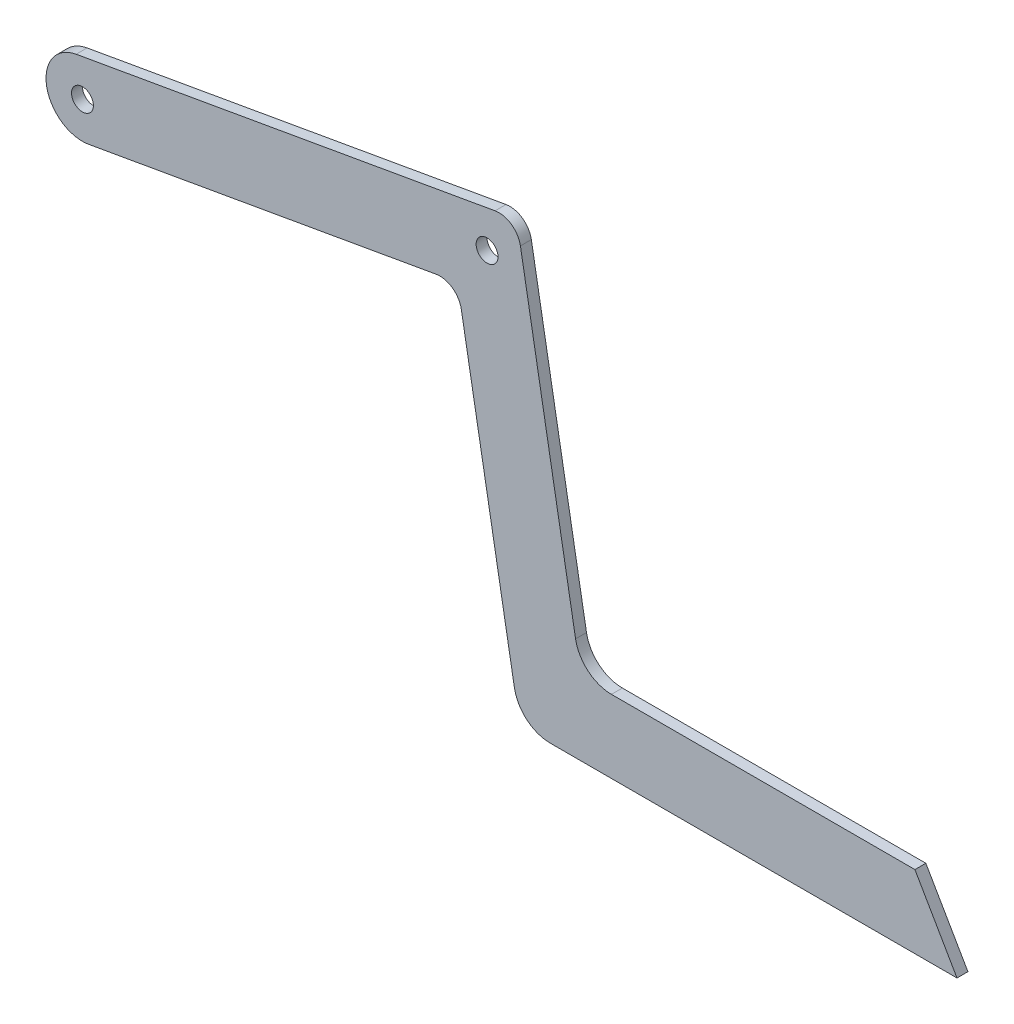
ISO-10303-21;
HEADER;
FILE_DESCRIPTION(('STEP AP214'),'2;1');
FILE_NAME('part.step','',(''),(''),'','','');
FILE_SCHEMA(('AUTOMOTIVE_DESIGN { 1 0 10303 214 1 1 1 1 }'));
ENDSEC;
DATA;
#1=APPLICATION_CONTEXT('core data for automotive mechanical design processes');
#2=APPLICATION_PROTOCOL_DEFINITION('international standard','automotive_design',2000,#1);
#3=PRODUCT_CONTEXT('',#1,'mechanical');
#4=PRODUCT('Part','Part','',(#3));
#5=PRODUCT_RELATED_PRODUCT_CATEGORY('part','',(#4));
#6=PRODUCT_DEFINITION_FORMATION('','',#4);
#7=PRODUCT_DEFINITION_CONTEXT('part definition',#1,'design');
#8=PRODUCT_DEFINITION('design','',#6,#7);
#9=PRODUCT_DEFINITION_SHAPE('','',#8);
#10=(LENGTH_UNIT() NAMED_UNIT(*) SI_UNIT(.MILLI.,.METRE.));
#11=(NAMED_UNIT(*) PLANE_ANGLE_UNIT() SI_UNIT($,.RADIAN.));
#12=(NAMED_UNIT(*) SI_UNIT($,.STERADIAN.) SOLID_ANGLE_UNIT());
#13=UNCERTAINTY_MEASURE_WITH_UNIT(LENGTH_MEASURE(1.E-05),#10,'distance_accuracy_value','');
#14=(GEOMETRIC_REPRESENTATION_CONTEXT(3) GLOBAL_UNCERTAINTY_ASSIGNED_CONTEXT((#13)) GLOBAL_UNIT_ASSIGNED_CONTEXT((#10,
#11,#12)) REPRESENTATION_CONTEXT('',''));
#15=CARTESIAN_POINT('',(0.,0.,0.));
#16=DIRECTION('',(0.,0.,1.));
#17=DIRECTION('',(1.,0.,0.));
#18=AXIS2_PLACEMENT_3D('',#15,#16,#17);
#19=CARTESIAN_POINT('',(4.19549815590958,5.00000000000001,0.75));
#20=DIRECTION('',(0.,0.,1.));
#21=DIRECTION('',(1.,0.,0.));
#22=AXIS2_PLACEMENT_3D('',#19,#20,#21);
#23=PLANE('',#22);
#24=CARTESIAN_POINT('',(-60.,44.4182492595607,0.75));
#25=DIRECTION('',(0.,0.,1.));
#26=DIRECTION('',(1.,0.,0.));
#27=AXIS2_PLACEMENT_3D('',#24,#25,#26);
#28=CIRCLE('',#27,1.5);
#29=CARTESIAN_POINT('',(-58.5,44.4182492595607,0.75));
#30=VERTEX_POINT('',#29);
#31=EDGE_CURVE('E162',#30,#30,#28,.T.);
#32=ORIENTED_EDGE('',*,*,#31,.F.);
#33=EDGE_LOOP('',(#32));
#34=FACE_BOUND('',#33,.T.);
#35=CARTESIAN_POINT('',(4.19549815590958,5.00000000000001,0.75));
#36=DIRECTION('',(0.,0.,1.));
#37=DIRECTION('',(1.,0.,0.));
#38=AXIS2_PLACEMENT_3D('',#35,#36,#37);
#39=CIRCLE('',#38,5.00000000000006);
#40=CARTESIAN_POINT('',(-0.728540609152036,4.13175911166798,0.75));
#41=VERTEX_POINT('',#40);
#42=CARTESIAN_POINT('',(4.19549815590947,0.,0.75));
#43=VERTEX_POINT('',#42);
#44=EDGE_CURVE('E181',#41,#43,#39,.T.);
#45=ORIENTED_EDGE('',*,*,#44,.T.);
#46=DIRECTION('',(1.,0.,0.));
#47=VECTOR('',#46,1.);
#48=CARTESIAN_POINT('',(4.19549815590947,0.,0.75));
#49=LINE('',#48,#47);
#50=CARTESIAN_POINT('',(60.,0.,0.75));
#51=VERTEX_POINT('',#50);
#52=EDGE_CURVE('E109',#43,#51,#49,.T.);
#53=ORIENTED_EDGE('',*,*,#52,.T.);
#54=DIRECTION('',(-0.500000000000005,0.866025403784436,0.));
#55=VECTOR('',#54,1.);
#56=CARTESIAN_POINT('',(60.,0.,0.75));
#57=LINE('',#56,#55);
#58=CARTESIAN_POINT('',(54.2264973081037,10.,0.75));
#59=VERTEX_POINT('',#58);
#60=EDGE_CURVE('E208',#51,#59,#57,.T.);
#61=ORIENTED_EDGE('',*,*,#60,.T.);
#62=DIRECTION('',(-1.,0.,0.));
#63=VECTOR('',#62,1.);
#64=CARTESIAN_POINT('',(54.2264973081037,10.,0.75));
#65=LINE('',#64,#63);
#66=CARTESIAN_POINT('',(12.5864944676832,9.99999999999995,0.75));
#67=VERTEX_POINT('',#66);
#68=EDGE_CURVE('E227',#59,#67,#65,.T.);
#69=ORIENTED_EDGE('',*,*,#68,.T.);
#70=CARTESIAN_POINT('',(12.5864944676833,15.,0.75));
#71=DIRECTION('',(0.,0.,-1.));
#72=DIRECTION('',(1.,0.,0.));
#73=AXIS2_PLACEMENT_3D('',#70,#71,#72);
#74=CIRCLE('',#73,5.00000000000005);
#75=CARTESIAN_POINT('',(7.66245570262213,14.1317591116654,0.75));
#76=VERTEX_POINT('',#75);
#77=EDGE_CURVE('E224',#67,#76,#74,.T.);
#78=ORIENTED_EDGE('',*,*,#77,.T.);
#79=DIRECTION('',(-0.173648177666937,0.984807753012207,0.));
#80=VECTOR('',#79,1.);
#81=CARTESIAN_POINT('',(7.66245570262213,14.1317591116654,0.75));
#82=LINE('',#81,#80);
#83=CARTESIAN_POINT('',(0.0955918093733577,57.0455767409672,0.75));
#84=VERTEX_POINT('',#83);
#85=EDGE_CURVE('E226',#76,#84,#82,.T.);
#86=ORIENTED_EDGE('',*,*,#85,.T.);
#87=CARTESIAN_POINT('',(-2.85883144965899,56.5246322079671,0.75));
#88=DIRECTION('',(0.,0.,1.));
#89=DIRECTION('',(1.,0.,0.));
#90=AXIS2_PLACEMENT_3D('',#87,#88,#89);
#91=CIRCLE('',#90,2.99999999999566);
#92=CARTESIAN_POINT('',(-3.37977598265879,59.4790554669995,0.75));
#93=VERTEX_POINT('',#92);
#94=EDGE_CURVE('E229',#84,#93,#91,.T.);
#95=ORIENTED_EDGE('',*,*,#94,.T.);
#96=DIRECTION('',(-0.984807753012222,-0.173648177666854,0.));
#97=VECTOR('',#96,1.);
#98=CARTESIAN_POINT('',(-3.37977598265879,59.4790554669995,0.75));
#99=LINE('',#98,#97);
#100=CARTESIAN_POINT('',(-60.8682408883343,49.3422880246218,0.75));
#101=VERTEX_POINT('',#100);
#102=EDGE_CURVE('E235',#93,#101,#99,.T.);
#103=ORIENTED_EDGE('',*,*,#102,.T.);
#104=CARTESIAN_POINT('',(-60.,44.4182492595607,0.75));
#105=DIRECTION('',(0.,0.,1.));
#106=DIRECTION('',(1.,0.,0.));
#107=AXIS2_PLACEMENT_3D('',#104,#105,#106);
#108=CIRCLE('',#107,5.);
#109=CARTESIAN_POINT('',(-59.1317591116657,39.4942104944996,0.75));
#110=VERTEX_POINT('',#109);
#111=EDGE_CURVE('E140',#101,#110,#108,.T.);
#112=ORIENTED_EDGE('',*,*,#111,.T.);
#113=DIRECTION('',(0.984807753012221,0.173648177666854,0.));
#114=VECTOR('',#113,1.);
#115=CARTESIAN_POINT('',(-11.4913717361126,47.8944961602088,0.75));
#116=LINE('',#115,#114);
#117=CARTESIAN_POINT('',(-11.4913717361126,47.8944961602087,0.75));
#118=VERTEX_POINT('',#117);
#119=EDGE_CURVE('E134',#110,#118,#116,.T.);
#120=ORIENTED_EDGE('',*,*,#119,.T.);
#121=CARTESIAN_POINT('',(-10.9704272031127,44.9400729011758,0.75));
#122=DIRECTION('',(0.,0.,-1.));
#123=DIRECTION('',(-1.,0.,0.));
#124=AXIS2_PLACEMENT_3D('',#121,#122,#123);
#125=CIRCLE('',#124,2.9999999999962);
#126=CARTESIAN_POINT('',(-8.01600394407981,45.4610174341759,0.75));
#127=VERTEX_POINT('',#126);
#128=EDGE_CURVE('E138',#118,#127,#125,.T.);
#129=ORIENTED_EDGE('',*,*,#128,.T.);
#130=DIRECTION('',(0.173648177666925,-0.984807753012209,0.));
#131=VECTOR('',#130,1.);
#132=CARTESIAN_POINT('',(-8.01600394407981,45.4610174341759,0.75));
#133=LINE('',#132,#131);
#134=EDGE_CURVE('E54',#127,#41,#133,.T.);
#135=ORIENTED_EDGE('',*,*,#134,.T.);
#136=EDGE_LOOP('',(#45,#53,#61,#69,#78,#86,#95,#103,#112,#120,#129,#135));
#137=FACE_BOUND('',#136,.T.);
#138=CARTESIAN_POINT('',(-4.48115060035267,54.2077203466046,0.75));
#139=DIRECTION('',(0.,0.,1.));
#140=DIRECTION('',(1.,0.,0.));
#141=AXIS2_PLACEMENT_3D('',#138,#139,#140);
#142=CIRCLE('',#141,1.5);
#143=CARTESIAN_POINT('',(-2.98115060035267,54.2077203466046,0.75));
#144=VERTEX_POINT('',#143);
#145=EDGE_CURVE('E277',#144,#144,#142,.T.);
#146=ORIENTED_EDGE('',*,*,#145,.F.);
#147=EDGE_LOOP('',(#146));
#148=FACE_BOUND('',#147,.T.);
#149=ADVANCED_FACE('F37',(#34,#137,#148),#23,.T.);
#150=CARTESIAN_POINT('',(4.19549815590958,5.00000000000001,-0.75));
#151=DIRECTION('',(0.,0.,1.));
#152=DIRECTION('',(1.,0.,0.));
#153=AXIS2_PLACEMENT_3D('',#150,#151,#152);
#154=PLANE('',#153);
#155=CARTESIAN_POINT('',(4.19549815590958,5.00000000000001,-0.75));
#156=DIRECTION('',(0.,0.,1.));
#157=DIRECTION('',(1.,0.,0.));
#158=AXIS2_PLACEMENT_3D('',#155,#156,#157);
#159=CIRCLE('',#158,5.00000000000006);
#160=CARTESIAN_POINT('',(-0.728540609152036,4.13175911166798,-0.75));
#161=VERTEX_POINT('',#160);
#162=CARTESIAN_POINT('',(4.19549815590947,0.,-0.75));
#163=VERTEX_POINT('',#162);
#164=EDGE_CURVE('E158',#161,#163,#159,.T.);
#165=ORIENTED_EDGE('',*,*,#164,.F.);
#166=DIRECTION('',(0.173648177666925,-0.984807753012209,0.));
#167=VECTOR('',#166,1.);
#168=CARTESIAN_POINT('',(-8.01600394407981,45.4610174341759,-0.75));
#169=LINE('',#168,#167);
#170=CARTESIAN_POINT('',(-8.01600394407981,45.4610174341759,-0.75));
#171=VERTEX_POINT('',#170);
#172=EDGE_CURVE('E101',#171,#161,#169,.T.);
#173=ORIENTED_EDGE('',*,*,#172,.F.);
#174=CARTESIAN_POINT('',(-10.9704272031127,44.9400729011758,-0.75));
#175=DIRECTION('',(0.,0.,-1.));
#176=DIRECTION('',(-1.,0.,0.));
#177=AXIS2_PLACEMENT_3D('',#174,#175,#176);
#178=CIRCLE('',#177,2.9999999999962);
#179=CARTESIAN_POINT('',(-11.4913717361126,47.8944961602087,-0.75));
#180=VERTEX_POINT('',#179);
#181=EDGE_CURVE('E95',#180,#171,#178,.T.);
#182=ORIENTED_EDGE('',*,*,#181,.F.);
#183=DIRECTION('',(0.984807753012221,0.173648177666854,0.));
#184=VECTOR('',#183,1.);
#185=CARTESIAN_POINT('',(-11.4913717361126,47.8944961602088,-0.75));
#186=LINE('',#185,#184);
#187=CARTESIAN_POINT('',(-59.1317591116657,39.4942104944996,-0.75));
#188=VERTEX_POINT('',#187);
#189=EDGE_CURVE('E148',#188,#180,#186,.T.);
#190=ORIENTED_EDGE('',*,*,#189,.F.);
#191=CARTESIAN_POINT('',(-60.,44.4182492595607,-0.75));
#192=DIRECTION('',(0.,0.,1.));
#193=DIRECTION('',(1.,0.,0.));
#194=AXIS2_PLACEMENT_3D('',#191,#192,#193);
#195=CIRCLE('',#194,5.);
#196=CARTESIAN_POINT('',(-60.8682408883343,49.3422880246218,-0.75));
#197=VERTEX_POINT('',#196);
#198=EDGE_CURVE('E176',#197,#188,#195,.T.);
#199=ORIENTED_EDGE('',*,*,#198,.F.);
#200=DIRECTION('',(-0.984807753012222,-0.173648177666854,0.));
#201=VECTOR('',#200,1.);
#202=CARTESIAN_POINT('',(-3.37977598265879,59.4790554669995,-0.75));
#203=LINE('',#202,#201);
#204=CARTESIAN_POINT('',(-3.37977598265879,59.4790554669995,-0.75));
#205=VERTEX_POINT('',#204);
#206=EDGE_CURVE('E174',#205,#197,#203,.T.);
#207=ORIENTED_EDGE('',*,*,#206,.F.);
#208=CARTESIAN_POINT('',(-2.85883144965899,56.5246322079671,-0.75));
#209=DIRECTION('',(0.,0.,1.));
#210=DIRECTION('',(1.,0.,0.));
#211=AXIS2_PLACEMENT_3D('',#208,#209,#210);
#212=CIRCLE('',#211,2.99999999999566);
#213=CARTESIAN_POINT('',(0.0955918093733577,57.0455767409672,-0.75));
#214=VERTEX_POINT('',#213);
#215=EDGE_CURVE('E172',#214,#205,#212,.T.);
#216=ORIENTED_EDGE('',*,*,#215,.F.);
#217=DIRECTION('',(-0.173648177666937,0.984807753012207,0.));
#218=VECTOR('',#217,1.);
#219=CARTESIAN_POINT('',(7.66245570262213,14.1317591116654,-0.75));
#220=LINE('',#219,#218);
#221=CARTESIAN_POINT('',(7.66245570262213,14.1317591116654,-0.75));
#222=VERTEX_POINT('',#221);
#223=EDGE_CURVE('E170',#222,#214,#220,.T.);
#224=ORIENTED_EDGE('',*,*,#223,.F.);
#225=CARTESIAN_POINT('',(12.5864944676833,15.,-0.75));
#226=DIRECTION('',(0.,0.,-1.));
#227=DIRECTION('',(1.,0.,0.));
#228=AXIS2_PLACEMENT_3D('',#225,#226,#227);
#229=CIRCLE('',#228,5.00000000000005);
#230=CARTESIAN_POINT('',(12.5864944676832,9.99999999999995,-0.75));
#231=VERTEX_POINT('',#230);
#232=EDGE_CURVE('E168',#231,#222,#229,.T.);
#233=ORIENTED_EDGE('',*,*,#232,.F.);
#234=DIRECTION('',(-1.,0.,0.));
#235=VECTOR('',#234,1.);
#236=CARTESIAN_POINT('',(54.2264973081037,10.,-0.75));
#237=LINE('',#236,#235);
#238=CARTESIAN_POINT('',(54.2264973081037,10.,-0.75));
#239=VERTEX_POINT('',#238);
#240=EDGE_CURVE('E166',#239,#231,#237,.T.);
#241=ORIENTED_EDGE('',*,*,#240,.F.);
#242=DIRECTION('',(-0.500000000000005,0.866025403784436,0.));
#243=VECTOR('',#242,1.);
#244=CARTESIAN_POINT('',(60.,0.,-0.75));
#245=LINE('',#244,#243);
#246=CARTESIAN_POINT('',(60.,0.,-0.75));
#247=VERTEX_POINT('',#246);
#248=EDGE_CURVE('E164',#247,#239,#245,.T.);
#249=ORIENTED_EDGE('',*,*,#248,.F.);
#250=DIRECTION('',(1.,0.,0.));
#251=VECTOR('',#250,1.);
#252=CARTESIAN_POINT('',(4.19549815590947,0.,-0.75));
#253=LINE('',#252,#251);
#254=EDGE_CURVE('E161',#163,#247,#253,.T.);
#255=ORIENTED_EDGE('',*,*,#254,.F.);
#256=EDGE_LOOP('',(#165,#173,#182,#190,#199,#207,#216,#224,#233,#241,#249,#255));
#257=FACE_BOUND('',#256,.T.);
#258=CARTESIAN_POINT('',(-60.,44.4182492595607,-0.75));
#259=DIRECTION('',(0.,0.,1.));
#260=DIRECTION('',(1.,0.,0.));
#261=AXIS2_PLACEMENT_3D('',#258,#259,#260);
#262=CIRCLE('',#261,1.5);
#263=CARTESIAN_POINT('',(-58.5,44.4182492595607,-0.75));
#264=VERTEX_POINT('',#263);
#265=EDGE_CURVE('E283',#264,#264,#262,.T.);
#266=ORIENTED_EDGE('',*,*,#265,.T.);
#267=EDGE_LOOP('',(#266));
#268=FACE_BOUND('',#267,.T.);
#269=CARTESIAN_POINT('',(-4.48115060035267,54.2077203466046,-0.75));
#270=DIRECTION('',(0.,0.,1.));
#271=DIRECTION('',(1.,0.,0.));
#272=AXIS2_PLACEMENT_3D('',#269,#270,#271);
#273=CIRCLE('',#272,1.5);
#274=CARTESIAN_POINT('',(-2.98115060035267,54.2077203466046,-0.75));
#275=VERTEX_POINT('',#274);
#276=EDGE_CURVE('E280',#275,#275,#273,.T.);
#277=ORIENTED_EDGE('',*,*,#276,.T.);
#278=EDGE_LOOP('',(#277));
#279=FACE_BOUND('',#278,.T.);
#280=ADVANCED_FACE('F212',(#257,#268,#279),#154,.F.);
#281=CARTESIAN_POINT('',(4.19549815590958,5.00000000000001,0.75));
#282=DIRECTION('',(0.,0.,-1.));
#283=DIRECTION('',(-1.,0.,0.));
#284=AXIS2_PLACEMENT_3D('',#281,#282,#283);
#285=CYLINDRICAL_SURFACE('',#284,5.00000000000006);
#286=ORIENTED_EDGE('',*,*,#164,.T.);
#287=DIRECTION('',(0.,0.,-1.));
#288=VECTOR('',#287,1.);
#289=CARTESIAN_POINT('',(4.19549815590947,0.,0.75));
#290=LINE('',#289,#288);
#291=EDGE_CURVE('E11',#43,#163,#290,.T.);
#292=ORIENTED_EDGE('',*,*,#291,.F.);
#293=ORIENTED_EDGE('',*,*,#44,.F.);
#294=DIRECTION('',(0.,0.,-1.));
#295=VECTOR('',#294,1.);
#296=CARTESIAN_POINT('',(-0.728540609152036,4.13175911166798,0.75));
#297=LINE('',#296,#295);
#298=EDGE_CURVE('E154',#41,#161,#297,.T.);
#299=ORIENTED_EDGE('',*,*,#298,.T.);
#300=EDGE_LOOP('',(#286,#292,#293,#299));
#301=FACE_BOUND('',#300,.T.);
#302=ADVANCED_FACE('F39',(#301),#285,.T.);
#303=CARTESIAN_POINT('',(4.19549815590947,0.,0.75));
#304=DIRECTION('',(0.,1.,0.));
#305=DIRECTION('',(-1.,0.,0.));
#306=AXIS2_PLACEMENT_3D('',#303,#304,#305);
#307=PLANE('',#306);
#308=ORIENTED_EDGE('',*,*,#254,.T.);
#309=DIRECTION('',(0.,0.,-1.));
#310=VECTOR('',#309,1.);
#311=CARTESIAN_POINT('',(60.,0.,0.75));
#312=LINE('',#311,#310);
#313=EDGE_CURVE('E46',#51,#247,#312,.T.);
#314=ORIENTED_EDGE('',*,*,#313,.F.);
#315=ORIENTED_EDGE('',*,*,#52,.F.);
#316=ORIENTED_EDGE('',*,*,#291,.T.);
#317=EDGE_LOOP('',(#308,#314,#315,#316));
#318=FACE_BOUND('',#317,.T.);
#319=ADVANCED_FACE('F376',(#318),#307,.F.);
#320=CARTESIAN_POINT('',(60.,0.,0.75));
#321=DIRECTION('',(-0.866025403784436,-0.500000000000004,0.));
#322=DIRECTION('',(0.500000000000005,-0.866025403784436,0.));
#323=AXIS2_PLACEMENT_3D('',#320,#321,#322);
#324=PLANE('',#323);
#325=ORIENTED_EDGE('',*,*,#248,.T.);
#326=DIRECTION('',(0.,0.,-1.));
#327=VECTOR('',#326,1.);
#328=CARTESIAN_POINT('',(54.2264973081037,10.,0.75));
#329=LINE('',#328,#327);
#330=EDGE_CURVE('E200',#59,#239,#329,.T.);
#331=ORIENTED_EDGE('',*,*,#330,.F.);
#332=ORIENTED_EDGE('',*,*,#60,.F.);
#333=ORIENTED_EDGE('',*,*,#313,.T.);
#334=EDGE_LOOP('',(#325,#331,#332,#333));
#335=FACE_BOUND('',#334,.T.);
#336=ADVANCED_FACE('F206',(#335),#324,.F.);
#337=CARTESIAN_POINT('',(54.2264973081037,10.,0.75));
#338=DIRECTION('',(0.,-1.,0.));
#339=DIRECTION('',(1.,0.,0.));
#340=AXIS2_PLACEMENT_3D('',#337,#338,#339);
#341=PLANE('',#340);
#342=ORIENTED_EDGE('',*,*,#240,.T.);
#343=DIRECTION('',(0.,0.,-1.));
#344=VECTOR('',#343,1.);
#345=CARTESIAN_POINT('',(12.5864944676832,9.99999999999995,0.75));
#346=LINE('',#345,#344);
#347=EDGE_CURVE('E197',#67,#231,#346,.T.);
#348=ORIENTED_EDGE('',*,*,#347,.F.);
#349=ORIENTED_EDGE('',*,*,#68,.F.);
#350=ORIENTED_EDGE('',*,*,#330,.T.);
#351=EDGE_LOOP('',(#342,#348,#349,#350));
#352=FACE_BOUND('',#351,.T.);
#353=ADVANCED_FACE('F218',(#352),#341,.F.);
#354=CARTESIAN_POINT('',(12.5864944676833,15.,0.75));
#355=DIRECTION('',(0.,0.,-1.));
#356=DIRECTION('',(-1.,0.,0.));
#357=AXIS2_PLACEMENT_3D('',#354,#355,#356);
#358=CYLINDRICAL_SURFACE('',#357,5.00000000000005);
#359=ORIENTED_EDGE('',*,*,#232,.T.);
#360=DIRECTION('',(0.,0.,-1.));
#361=VECTOR('',#360,1.);
#362=CARTESIAN_POINT('',(7.66245570262213,14.1317591116654,0.75));
#363=LINE('',#362,#361);
#364=EDGE_CURVE('E194',#76,#222,#363,.T.);
#365=ORIENTED_EDGE('',*,*,#364,.F.);
#366=ORIENTED_EDGE('',*,*,#77,.F.);
#367=ORIENTED_EDGE('',*,*,#347,.T.);
#368=EDGE_LOOP('',(#359,#365,#366,#367));
#369=FACE_BOUND('',#368,.T.);
#370=ADVANCED_FACE('F222',(#369),#358,.F.);
#371=CARTESIAN_POINT('',(7.66245570262213,14.1317591116654,0.75));
#372=DIRECTION('',(-0.984807753012207,-0.173648177666937,0.));
#373=DIRECTION('',(0.173648177666937,-0.984807753012207,0.));
#374=AXIS2_PLACEMENT_3D('',#371,#372,#373);
#375=PLANE('',#374);
#376=ORIENTED_EDGE('',*,*,#223,.T.);
#377=DIRECTION('',(0.,0.,-1.));
#378=VECTOR('',#377,1.);
#379=CARTESIAN_POINT('',(0.0955918093733577,57.0455767409672,0.75));
#380=LINE('',#379,#378);
#381=EDGE_CURVE('E191',#84,#214,#380,.T.);
#382=ORIENTED_EDGE('',*,*,#381,.F.);
#383=ORIENTED_EDGE('',*,*,#85,.F.);
#384=ORIENTED_EDGE('',*,*,#364,.T.);
#385=EDGE_LOOP('',(#376,#382,#383,#384));
#386=FACE_BOUND('',#385,.T.);
#387=ADVANCED_FACE('F341',(#386),#375,.F.);
#388=CARTESIAN_POINT('',(-2.85883144965899,56.5246322079671,0.75));
#389=DIRECTION('',(0.,0.,-1.));
#390=DIRECTION('',(-1.,0.,0.));
#391=AXIS2_PLACEMENT_3D('',#388,#389,#390);
#392=CYLINDRICAL_SURFACE('',#391,2.99999999999566);
#393=ORIENTED_EDGE('',*,*,#215,.T.);
#394=DIRECTION('',(0.,0.,-1.));
#395=VECTOR('',#394,1.);
#396=CARTESIAN_POINT('',(-3.37977598265879,59.4790554669995,0.75));
#397=LINE('',#396,#395);
#398=EDGE_CURVE('E188',#93,#205,#397,.T.);
#399=ORIENTED_EDGE('',*,*,#398,.F.);
#400=ORIENTED_EDGE('',*,*,#94,.F.);
#401=ORIENTED_EDGE('',*,*,#381,.T.);
#402=EDGE_LOOP('',(#393,#399,#400,#401));
#403=FACE_BOUND('',#402,.T.);
#404=ADVANCED_FACE('F332',(#403),#392,.T.);
#405=CARTESIAN_POINT('',(-3.37977598265879,59.4790554669995,0.75));
#406=DIRECTION('',(0.173648177666854,-0.984807753012222,0.));
#407=DIRECTION('',(0.984807753012222,0.173648177666854,0.));
#408=AXIS2_PLACEMENT_3D('',#405,#406,#407);
#409=PLANE('',#408);
#410=ORIENTED_EDGE('',*,*,#206,.T.);
#411=DIRECTION('',(0.,0.,-1.));
#412=VECTOR('',#411,1.);
#413=CARTESIAN_POINT('',(-60.8682408883343,49.3422880246218,0.75));
#414=LINE('',#413,#412);
#415=EDGE_CURVE('E185',#101,#197,#414,.T.);
#416=ORIENTED_EDGE('',*,*,#415,.F.);
#417=ORIENTED_EDGE('',*,*,#102,.F.);
#418=ORIENTED_EDGE('',*,*,#398,.T.);
#419=EDGE_LOOP('',(#410,#416,#417,#418));
#420=FACE_BOUND('',#419,.T.);
#421=ADVANCED_FACE('F241',(#420),#409,.F.);
#422=CARTESIAN_POINT('',(-60.,44.4182492595607,0.75));
#423=DIRECTION('',(0.,0.,-1.));
#424=DIRECTION('',(-1.,0.,0.));
#425=AXIS2_PLACEMENT_3D('',#422,#423,#424);
#426=CYLINDRICAL_SURFACE('',#425,5.);
#427=ORIENTED_EDGE('',*,*,#198,.T.);
#428=DIRECTION('',(0.,0.,-1.));
#429=VECTOR('',#428,1.);
#430=CARTESIAN_POINT('',(-59.1317591116657,39.4942104944996,0.75));
#431=LINE('',#430,#429);
#432=EDGE_CURVE('E149',#110,#188,#431,.T.);
#433=ORIENTED_EDGE('',*,*,#432,.F.);
#434=ORIENTED_EDGE('',*,*,#111,.F.);
#435=ORIENTED_EDGE('',*,*,#415,.T.);
#436=EDGE_LOOP('',(#427,#433,#434,#435));
#437=FACE_BOUND('',#436,.T.);
#438=ADVANCED_FACE('F245',(#437),#426,.T.);
#439=CARTESIAN_POINT('',(-11.4913717361126,47.8944961602088,0.75));
#440=DIRECTION('',(-0.173648177666854,0.984807753012222,0.));
#441=DIRECTION('',(-0.984807753012222,-0.173648177666854,0.));
#442=AXIS2_PLACEMENT_3D('',#439,#440,#441);
#443=PLANE('',#442);
#444=ORIENTED_EDGE('',*,*,#189,.T.);
#445=DIRECTION('',(0.,0.,-1.));
#446=VECTOR('',#445,1.);
#447=CARTESIAN_POINT('',(-11.4913717361126,47.8944961602087,0.75));
#448=LINE('',#447,#446);
#449=EDGE_CURVE('E145',#118,#180,#448,.T.);
#450=ORIENTED_EDGE('',*,*,#449,.F.);
#451=ORIENTED_EDGE('',*,*,#119,.F.);
#452=ORIENTED_EDGE('',*,*,#432,.T.);
#453=EDGE_LOOP('',(#444,#450,#451,#452));
#454=FACE_BOUND('',#453,.T.);
#455=ADVANCED_FACE('F146',(#454),#443,.F.);
#456=CARTESIAN_POINT('',(-10.9704272031127,44.9400729011758,0.75));
#457=DIRECTION('',(0.,0.,-1.));
#458=DIRECTION('',(-1.,0.,0.));
#459=AXIS2_PLACEMENT_3D('',#456,#457,#458);
#460=CYLINDRICAL_SURFACE('',#459,2.9999999999962);
#461=ORIENTED_EDGE('',*,*,#181,.T.);
#462=DIRECTION('',(0.,0.,-1.));
#463=VECTOR('',#462,1.);
#464=CARTESIAN_POINT('',(-8.01600394407981,45.4610174341759,0.75));
#465=LINE('',#464,#463);
#466=EDGE_CURVE('E150',#127,#171,#465,.T.);
#467=ORIENTED_EDGE('',*,*,#466,.F.);
#468=ORIENTED_EDGE('',*,*,#128,.F.);
#469=ORIENTED_EDGE('',*,*,#449,.T.);
#470=EDGE_LOOP('',(#461,#467,#468,#469));
#471=FACE_BOUND('',#470,.T.);
#472=ADVANCED_FACE('F152',(#471),#460,.F.);
#473=CARTESIAN_POINT('',(-8.01600394407981,45.4610174341759,0.75));
#474=DIRECTION('',(0.984807753012209,0.173648177666925,0.));
#475=DIRECTION('',(-0.173648177666925,0.984807753012209,0.));
#476=AXIS2_PLACEMENT_3D('',#473,#474,#475);
#477=PLANE('',#476);
#478=ORIENTED_EDGE('',*,*,#172,.T.);
#479=ORIENTED_EDGE('',*,*,#298,.F.);
#480=ORIENTED_EDGE('',*,*,#134,.F.);
#481=ORIENTED_EDGE('',*,*,#466,.T.);
#482=EDGE_LOOP('',(#478,#479,#480,#481));
#483=FACE_BOUND('',#482,.T.);
#484=ADVANCED_FACE('F249',(#483),#477,.F.);
#485=CARTESIAN_POINT('',(-60.,44.4182492595607,0.75));
#486=DIRECTION('',(0.,0.,-1.));
#487=DIRECTION('',(-1.,0.,0.));
#488=AXIS2_PLACEMENT_3D('',#485,#486,#487);
#489=CYLINDRICAL_SURFACE('',#488,1.5);
#490=ORIENTED_EDGE('',*,*,#31,.T.);
#491=EDGE_LOOP('',(#490));
#492=FACE_BOUND('',#491,.T.);
#493=ORIENTED_EDGE('',*,*,#265,.F.);
#494=EDGE_LOOP('',(#493));
#495=FACE_BOUND('',#494,.T.);
#496=ADVANCED_FACE('F251',(#492,#495),#489,.F.);
#497=CARTESIAN_POINT('',(-4.48115060035267,54.2077203466046,0.75));
#498=DIRECTION('',(0.,0.,-1.));
#499=DIRECTION('',(-1.,0.,0.));
#500=AXIS2_PLACEMENT_3D('',#497,#498,#499);
#501=CYLINDRICAL_SURFACE('',#500,1.5);
#502=ORIENTED_EDGE('',*,*,#145,.T.);
#503=EDGE_LOOP('',(#502));
#504=FACE_BOUND('',#503,.T.);
#505=ORIENTED_EDGE('',*,*,#276,.F.);
#506=EDGE_LOOP('',(#505));
#507=FACE_BOUND('',#506,.T.);
#508=ADVANCED_FACE('F257',(#504,#507),#501,.F.);
#509=CLOSED_SHELL('',(#149,#280,#302,#319,#336,#353,#370,#387,#404,#421,#438,#455,#472,#484,
#496,#508));
#510=MANIFOLD_SOLID_BREP('B2',#509);
#511=ADVANCED_BREP_SHAPE_REPRESENTATION('',(#18,#510),#14);
#512=SHAPE_DEFINITION_REPRESENTATION(#9,#511);
ENDSEC;
END-ISO-10303-21;
